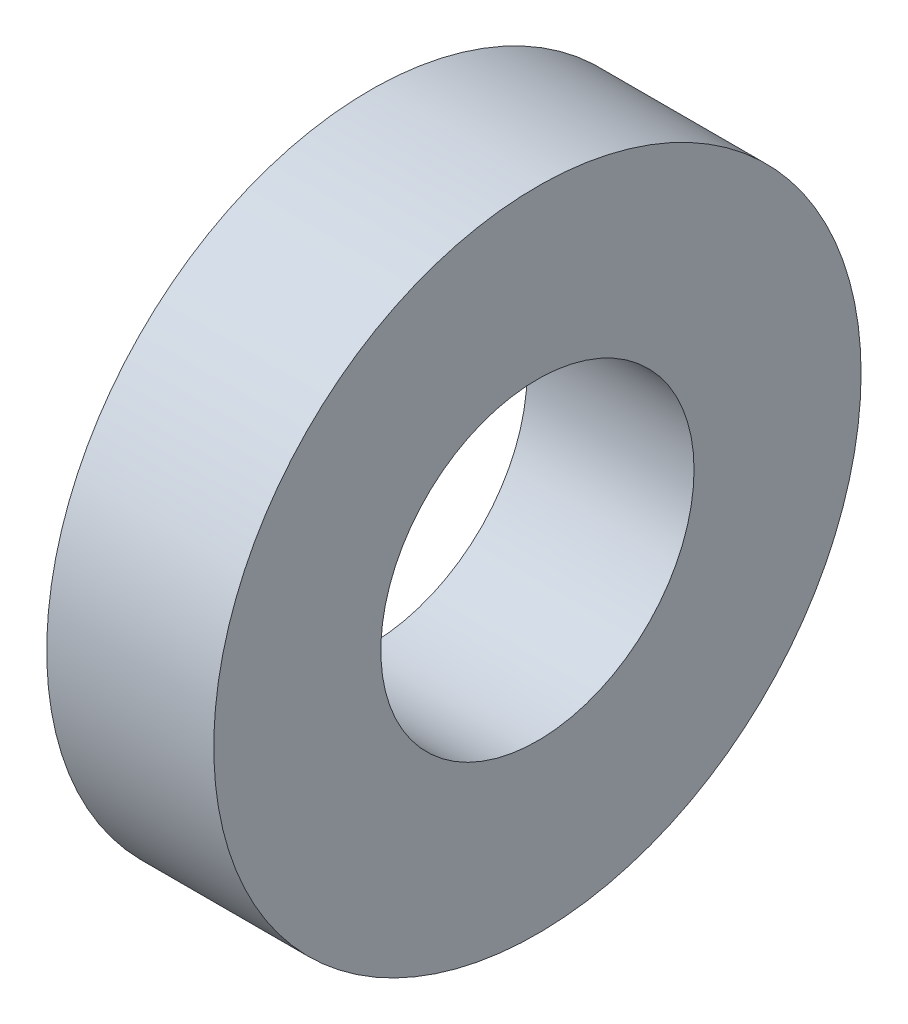
ISO-10303-21;
HEADER;
FILE_DESCRIPTION(('STEP AP214'),'2;1');
FILE_NAME('part.step','',(''),(''),'','','');
FILE_SCHEMA(('AUTOMOTIVE_DESIGN { 1 0 10303 214 1 1 1 1 }'));
ENDSEC;
DATA;
#1=APPLICATION_CONTEXT('core data for automotive mechanical design processes');
#2=APPLICATION_PROTOCOL_DEFINITION('international standard','automotive_design',2000,#1);
#3=PRODUCT_CONTEXT('',#1,'mechanical');
#4=PRODUCT('Part','Part','',(#3));
#5=PRODUCT_RELATED_PRODUCT_CATEGORY('part','',(#4));
#6=PRODUCT_DEFINITION_FORMATION('','',#4);
#7=PRODUCT_DEFINITION_CONTEXT('part definition',#1,'design');
#8=PRODUCT_DEFINITION('design','',#6,#7);
#9=PRODUCT_DEFINITION_SHAPE('','',#8);
#10=(LENGTH_UNIT() NAMED_UNIT(*) SI_UNIT(.MILLI.,.METRE.));
#11=(NAMED_UNIT(*) PLANE_ANGLE_UNIT() SI_UNIT($,.RADIAN.));
#12=(NAMED_UNIT(*) SI_UNIT($,.STERADIAN.) SOLID_ANGLE_UNIT());
#13=UNCERTAINTY_MEASURE_WITH_UNIT(LENGTH_MEASURE(1.E-05),#10,'distance_accuracy_value','');
#14=(GEOMETRIC_REPRESENTATION_CONTEXT(3) GLOBAL_UNCERTAINTY_ASSIGNED_CONTEXT((#13)) GLOBAL_UNIT_ASSIGNED_CONTEXT((#10,
#11,#12)) REPRESENTATION_CONTEXT('',''));
#15=CARTESIAN_POINT('',(0.,0.,0.));
#16=DIRECTION('',(0.,0.,1.));
#17=DIRECTION('',(1.,0.,0.));
#18=AXIS2_PLACEMENT_3D('',#15,#16,#17);
#19=CARTESIAN_POINT('',(16.,0.,0.));
#20=DIRECTION('',(1.,0.,0.));
#21=DIRECTION('',(0.,0.,-1.));
#22=AXIS2_PLACEMENT_3D('',#19,#20,#21);
#23=PLANE('',#22);
#24=CARTESIAN_POINT('',(16.,0.,0.));
#25=DIRECTION('',(1.,0.,0.));
#26=DIRECTION('',(0.,0.,-1.));
#27=AXIS2_PLACEMENT_3D('',#24,#25,#26);
#28=CIRCLE('',#27,31.);
#29=CARTESIAN_POINT('',(16.,0.,-31.));
#30=VERTEX_POINT('',#29);
#31=EDGE_CURVE('E10',#30,#30,#28,.T.);
#32=ORIENTED_EDGE('',*,*,#31,.T.);
#33=EDGE_LOOP('',(#32));
#34=FACE_BOUND('',#33,.T.);
#35=CARTESIAN_POINT('',(16.,0.,0.));
#36=DIRECTION('',(1.,0.,0.));
#37=DIRECTION('',(0.,0.,-1.));
#38=AXIS2_PLACEMENT_3D('',#35,#36,#37);
#39=CIRCLE('',#38,15.);
#40=CARTESIAN_POINT('',(16.,0.,-15.));
#41=VERTEX_POINT('',#40);
#42=EDGE_CURVE('E43',#41,#41,#39,.T.);
#43=ORIENTED_EDGE('',*,*,#42,.F.);
#44=EDGE_LOOP('',(#43));
#45=FACE_BOUND('',#44,.T.);
#46=ADVANCED_FACE('F32',(#34,#45),#23,.T.);
#47=CARTESIAN_POINT('',(0.,0.,0.));
#48=DIRECTION('',(1.,0.,0.));
#49=DIRECTION('',(0.,0.,-1.));
#50=AXIS2_PLACEMENT_3D('',#47,#48,#49);
#51=PLANE('',#50);
#52=CARTESIAN_POINT('',(0.,0.,0.));
#53=DIRECTION('',(1.,0.,0.));
#54=DIRECTION('',(0.,0.,-1.));
#55=AXIS2_PLACEMENT_3D('',#52,#53,#54);
#56=CIRCLE('',#55,31.);
#57=CARTESIAN_POINT('',(0.,0.,-31.));
#58=VERTEX_POINT('',#57);
#59=EDGE_CURVE('E36',#58,#58,#56,.T.);
#60=ORIENTED_EDGE('',*,*,#59,.F.);
#61=EDGE_LOOP('',(#60));
#62=FACE_BOUND('',#61,.T.);
#63=CARTESIAN_POINT('',(0.,0.,0.));
#64=DIRECTION('',(1.,0.,0.));
#65=DIRECTION('',(0.,0.,-1.));
#66=AXIS2_PLACEMENT_3D('',#63,#64,#65);
#67=CIRCLE('',#66,15.);
#68=CARTESIAN_POINT('',(0.,0.,-15.));
#69=VERTEX_POINT('',#68);
#70=EDGE_CURVE('E45',#69,#69,#67,.T.);
#71=ORIENTED_EDGE('',*,*,#70,.T.);
#72=EDGE_LOOP('',(#71));
#73=FACE_BOUND('',#72,.T.);
#74=ADVANCED_FACE('F55',(#62,#73),#51,.F.);
#75=CARTESIAN_POINT('',(16.,0.,0.));
#76=DIRECTION('',(-1.,0.,0.));
#77=DIRECTION('',(0.,0.,1.));
#78=AXIS2_PLACEMENT_3D('',#75,#76,#77);
#79=CYLINDRICAL_SURFACE('',#78,31.);
#80=ORIENTED_EDGE('',*,*,#31,.F.);
#81=EDGE_LOOP('',(#80));
#82=FACE_BOUND('',#81,.T.);
#83=ORIENTED_EDGE('',*,*,#59,.T.);
#84=EDGE_LOOP('',(#83));
#85=FACE_BOUND('',#84,.T.);
#86=ADVANCED_FACE('F34',(#82,#85),#79,.T.);
#87=CARTESIAN_POINT('',(16.,0.,0.));
#88=DIRECTION('',(-1.,0.,0.));
#89=DIRECTION('',(0.,0.,1.));
#90=AXIS2_PLACEMENT_3D('',#87,#88,#89);
#91=CYLINDRICAL_SURFACE('',#90,15.);
#92=ORIENTED_EDGE('',*,*,#42,.T.);
#93=EDGE_LOOP('',(#92));
#94=FACE_BOUND('',#93,.T.);
#95=ORIENTED_EDGE('',*,*,#70,.F.);
#96=EDGE_LOOP('',(#95));
#97=FACE_BOUND('',#96,.T.);
#98=ADVANCED_FACE('F51',(#94,#97),#91,.F.);
#99=CLOSED_SHELL('',(#46,#74,#86,#98));
#100=MANIFOLD_SOLID_BREP('B2',#99);
#101=ADVANCED_BREP_SHAPE_REPRESENTATION('',(#18,#100),#14);
#102=SHAPE_DEFINITION_REPRESENTATION(#9,#101);
ENDSEC;
END-ISO-10303-21;
